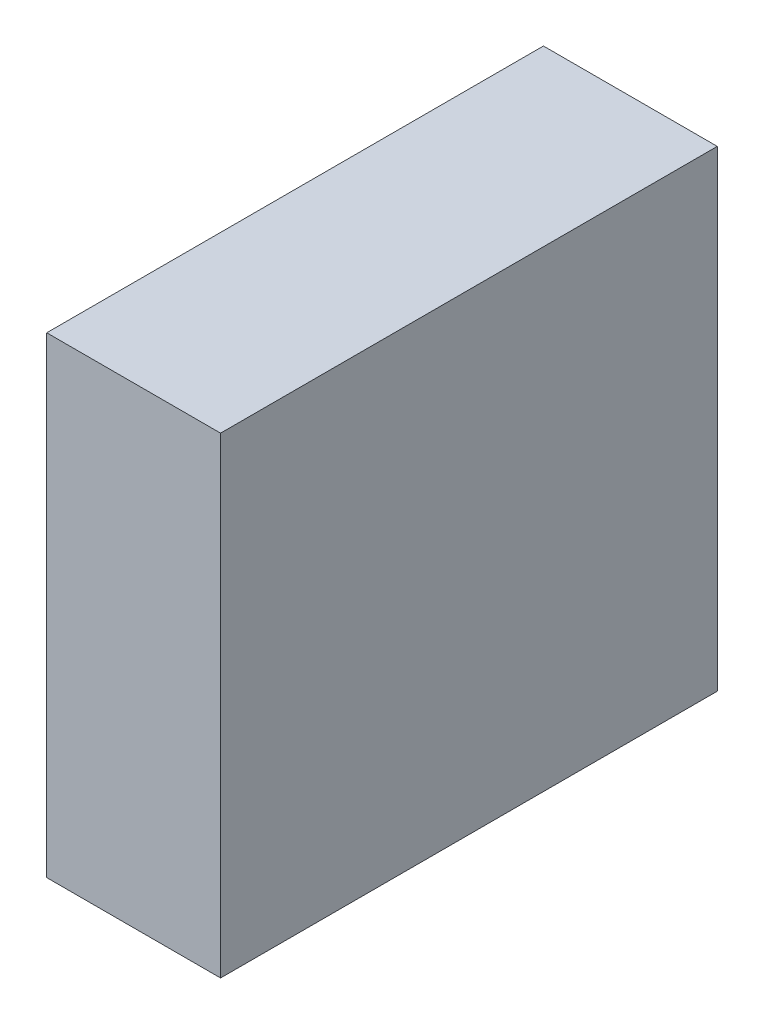
ISO-10303-21;
HEADER;
FILE_DESCRIPTION(('STEP AP214'),'2;1');
FILE_NAME('part.step','',(''),(''),'','','');
FILE_SCHEMA(('AUTOMOTIVE_DESIGN { 1 0 10303 214 1 1 1 1 }'));
ENDSEC;
DATA;
#1=APPLICATION_CONTEXT('core data for automotive mechanical design processes');
#2=APPLICATION_PROTOCOL_DEFINITION('international standard','automotive_design',2000,#1);
#3=PRODUCT_CONTEXT('',#1,'mechanical');
#4=PRODUCT('Part','Part','',(#3));
#5=PRODUCT_RELATED_PRODUCT_CATEGORY('part','',(#4));
#6=PRODUCT_DEFINITION_FORMATION('','',#4);
#7=PRODUCT_DEFINITION_CONTEXT('part definition',#1,'design');
#8=PRODUCT_DEFINITION('design','',#6,#7);
#9=PRODUCT_DEFINITION_SHAPE('','',#8);
#10=(LENGTH_UNIT() NAMED_UNIT(*) SI_UNIT(.MILLI.,.METRE.));
#11=(NAMED_UNIT(*) PLANE_ANGLE_UNIT() SI_UNIT($,.RADIAN.));
#12=(NAMED_UNIT(*) SI_UNIT($,.STERADIAN.) SOLID_ANGLE_UNIT());
#13=UNCERTAINTY_MEASURE_WITH_UNIT(LENGTH_MEASURE(1.E-05),#10,'distance_accuracy_value','');
#14=(GEOMETRIC_REPRESENTATION_CONTEXT(3) GLOBAL_UNCERTAINTY_ASSIGNED_CONTEXT((#13)) GLOBAL_UNIT_ASSIGNED_CONTEXT((#10,
#11,#12)) REPRESENTATION_CONTEXT('',''));
#15=CARTESIAN_POINT('',(0.,0.,0.));
#16=DIRECTION('',(0.,0.,1.));
#17=DIRECTION('',(1.,0.,0.));
#18=AXIS2_PLACEMENT_3D('',#15,#16,#17);
#19=CARTESIAN_POINT('',(-0.17500092,0.47500032,0.));
#20=DIRECTION('',(1.,0.,0.));
#21=DIRECTION('',(0.,0.,-1.));
#22=AXIS2_PLACEMENT_3D('',#19,#20,#21);
#23=PLANE('',#22);
#24=DIRECTION('',(0.,0.,1.));
#25=VECTOR('',#24,1.);
#26=CARTESIAN_POINT('',(-0.17500092,-0.47499778,0.));
#27=LINE('',#26,#25);
#28=CARTESIAN_POINT('',(-0.17500092,-0.47499778,0.));
#29=VERTEX_POINT('',#28);
#30=CARTESIAN_POINT('',(-0.17500092,-0.47499778,1.00000054));
#31=VERTEX_POINT('',#30);
#32=EDGE_CURVE('E20',#29,#31,#27,.T.);
#33=ORIENTED_EDGE('',*,*,#32,.T.);
#34=DIRECTION('',(0.,1.,0.));
#35=VECTOR('',#34,1.);
#36=CARTESIAN_POINT('',(-0.17500092,-0.47499778,1.00000054));
#37=LINE('',#36,#35);
#38=CARTESIAN_POINT('',(-0.17500092,0.47500032,1.00000054));
#39=VERTEX_POINT('',#38);
#40=EDGE_CURVE('E55',#31,#39,#37,.T.);
#41=ORIENTED_EDGE('',*,*,#40,.T.);
#42=DIRECTION('',(0.,0.,-1.));
#43=VECTOR('',#42,1.);
#44=CARTESIAN_POINT('',(-0.17500092,0.47500032,0.));
#45=LINE('',#44,#43);
#46=CARTESIAN_POINT('',(-0.17500092,0.47500032,0.));
#47=VERTEX_POINT('',#46);
#48=EDGE_CURVE('E76',#39,#47,#45,.T.);
#49=ORIENTED_EDGE('',*,*,#48,.T.);
#50=DIRECTION('',(0.,1.,0.));
#51=VECTOR('',#50,1.);
#52=CARTESIAN_POINT('',(-0.17500092,-0.47499778,0.));
#53=LINE('',#52,#51);
#54=EDGE_CURVE('E58',#29,#47,#53,.T.);
#55=ORIENTED_EDGE('',*,*,#54,.F.);
#56=EDGE_LOOP('',(#33,#41,#49,#55));
#57=FACE_BOUND('',#56,.T.);
#58=ADVANCED_FACE('F17',(#57),#23,.F.);
#59=CARTESIAN_POINT('',(-0.17500092,-0.47499778,0.));
#60=DIRECTION('',(0.,1.,0.));
#61=DIRECTION('',(0.,0.,1.));
#62=AXIS2_PLACEMENT_3D('',#59,#60,#61);
#63=PLANE('',#62);
#64=DIRECTION('',(0.,0.,1.));
#65=VECTOR('',#64,1.);
#66=CARTESIAN_POINT('',(0.17500092,-0.47499778,0.));
#67=LINE('',#66,#65);
#68=CARTESIAN_POINT('',(0.17500092,-0.47499778,0.));
#69=VERTEX_POINT('',#68);
#70=CARTESIAN_POINT('',(0.17500092,-0.47499778,1.00000054));
#71=VERTEX_POINT('',#70);
#72=EDGE_CURVE('E73',#69,#71,#67,.T.);
#73=ORIENTED_EDGE('',*,*,#72,.T.);
#74=DIRECTION('',(-1.,0.,0.));
#75=VECTOR('',#74,1.);
#76=CARTESIAN_POINT('',(0.17500092,-0.47499778,1.00000054));
#77=LINE('',#76,#75);
#78=EDGE_CURVE('E63',#71,#31,#77,.T.);
#79=ORIENTED_EDGE('',*,*,#78,.T.);
#80=ORIENTED_EDGE('',*,*,#32,.F.);
#81=DIRECTION('',(-1.,0.,0.));
#82=VECTOR('',#81,1.);
#83=CARTESIAN_POINT('',(0.17500092,-0.47499778,0.));
#84=LINE('',#83,#82);
#85=EDGE_CURVE('E78',#69,#29,#84,.T.);
#86=ORIENTED_EDGE('',*,*,#85,.F.);
#87=EDGE_LOOP('',(#73,#79,#80,#86));
#88=FACE_BOUND('',#87,.T.);
#89=ADVANCED_FACE('F72',(#88),#63,.F.);
#90=CARTESIAN_POINT('',(0.17500092,-0.47499778,1.00000054));
#91=DIRECTION('',(0.,0.,-1.));
#92=DIRECTION('',(-1.,0.,0.));
#93=AXIS2_PLACEMENT_3D('',#90,#91,#92);
#94=PLANE('',#93);
#95=DIRECTION('',(1.,0.,0.));
#96=VECTOR('',#95,1.);
#97=CARTESIAN_POINT('',(0.17500092,0.47500032,1.00000054));
#98=LINE('',#97,#96);
#99=CARTESIAN_POINT('',(0.17500092,0.47500032,1.00000054));
#100=VERTEX_POINT('',#99);
#101=EDGE_CURVE('E69',#100,#39,#98,.F.);
#102=ORIENTED_EDGE('',*,*,#101,.T.);
#103=ORIENTED_EDGE('',*,*,#40,.F.);
#104=ORIENTED_EDGE('',*,*,#78,.F.);
#105=DIRECTION('',(0.,1.,0.));
#106=VECTOR('',#105,1.);
#107=CARTESIAN_POINT('',(0.17500092,-0.47499778,1.00000054));
#108=LINE('',#107,#106);
#109=EDGE_CURVE('E83',#71,#100,#108,.T.);
#110=ORIENTED_EDGE('',*,*,#109,.T.);
#111=EDGE_LOOP('',(#102,#103,#104,#110));
#112=FACE_BOUND('',#111,.T.);
#113=ADVANCED_FACE('F66',(#112),#94,.F.);
#114=CARTESIAN_POINT('',(0.17500092,0.47500032,0.));
#115=DIRECTION('',(0.,-1.,0.));
#116=DIRECTION('',(0.,0.,-1.));
#117=AXIS2_PLACEMENT_3D('',#114,#115,#116);
#118=PLANE('',#117);
#119=ORIENTED_EDGE('',*,*,#48,.F.);
#120=ORIENTED_EDGE('',*,*,#101,.F.);
#121=DIRECTION('',(0.,0.,1.));
#122=VECTOR('',#121,1.);
#123=CARTESIAN_POINT('',(0.17500092,0.47500032,0.));
#124=LINE('',#123,#122);
#125=CARTESIAN_POINT('',(0.17500092,0.47500032,0.));
#126=VERTEX_POINT('',#125);
#127=EDGE_CURVE('E26',#100,#126,#124,.F.);
#128=ORIENTED_EDGE('',*,*,#127,.T.);
#129=DIRECTION('',(-1.,0.,0.));
#130=VECTOR('',#129,1.);
#131=CARTESIAN_POINT('',(0.17500092,0.47500032,0.));
#132=LINE('',#131,#130);
#133=EDGE_CURVE('E34',#47,#126,#132,.F.);
#134=ORIENTED_EDGE('',*,*,#133,.F.);
#135=EDGE_LOOP('',(#119,#120,#128,#134));
#136=FACE_BOUND('',#135,.T.);
#137=ADVANCED_FACE('F88',(#136),#118,.F.);
#138=CARTESIAN_POINT('',(0.17500092,-0.47499778,0.));
#139=DIRECTION('',(0.,0.,-1.));
#140=DIRECTION('',(-1.,0.,0.));
#141=AXIS2_PLACEMENT_3D('',#138,#139,#140);
#142=PLANE('',#141);
#143=ORIENTED_EDGE('',*,*,#133,.T.);
#144=DIRECTION('',(0.,1.,0.));
#145=VECTOR('',#144,1.);
#146=CARTESIAN_POINT('',(0.17500092,-0.47499778,0.));
#147=LINE('',#146,#145);
#148=EDGE_CURVE('E11',#126,#69,#147,.F.);
#149=ORIENTED_EDGE('',*,*,#148,.T.);
#150=ORIENTED_EDGE('',*,*,#85,.T.);
#151=ORIENTED_EDGE('',*,*,#54,.T.);
#152=EDGE_LOOP('',(#143,#149,#150,#151));
#153=FACE_BOUND('',#152,.T.);
#154=ADVANCED_FACE('F91',(#153),#142,.T.);
#155=CARTESIAN_POINT('',(0.17500092,-0.47499778,0.));
#156=DIRECTION('',(-1.,0.,0.));
#157=DIRECTION('',(0.,0.,1.));
#158=AXIS2_PLACEMENT_3D('',#155,#156,#157);
#159=PLANE('',#158);
#160=ORIENTED_EDGE('',*,*,#127,.F.);
#161=ORIENTED_EDGE('',*,*,#109,.F.);
#162=ORIENTED_EDGE('',*,*,#72,.F.);
#163=ORIENTED_EDGE('',*,*,#148,.F.);
#164=EDGE_LOOP('',(#160,#161,#162,#163));
#165=FACE_BOUND('',#164,.T.);
#166=ADVANCED_FACE('F90',(#165),#159,.F.);
#167=CLOSED_SHELL('',(#58,#89,#113,#137,#154,#166));
#168=MANIFOLD_SOLID_BREP('B1',#167);
#169=ADVANCED_BREP_SHAPE_REPRESENTATION('',(#18,#168),#14);
#170=SHAPE_DEFINITION_REPRESENTATION(#9,#169);
ENDSEC;
END-ISO-10303-21;
